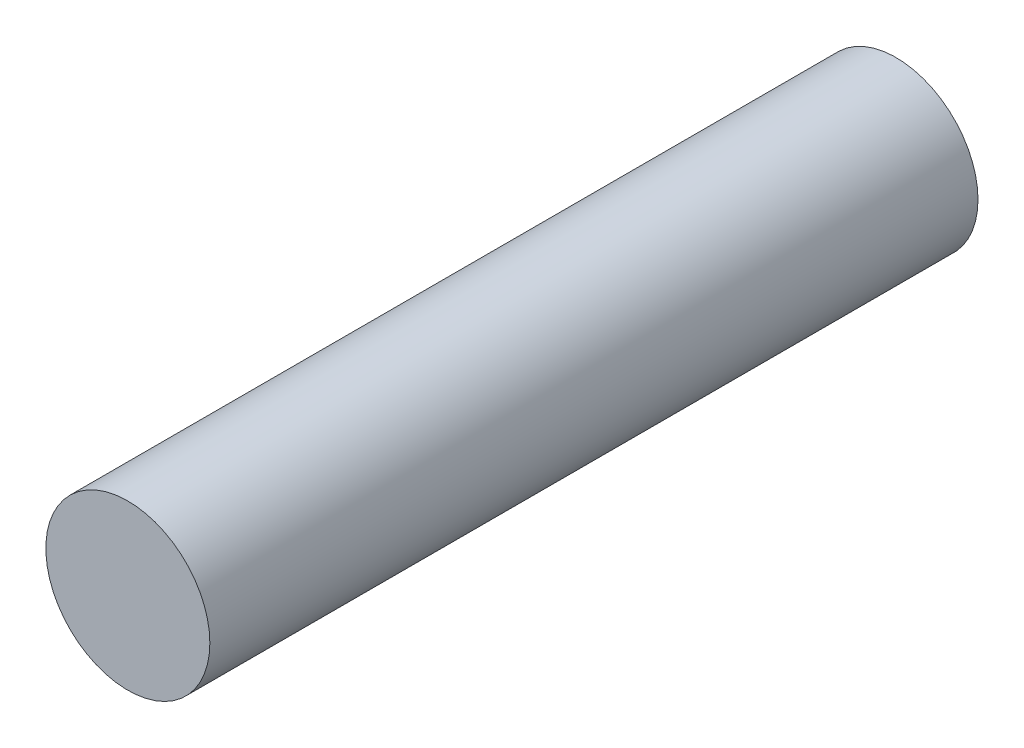
ISO-10303-21;
HEADER;
FILE_DESCRIPTION(('STEP AP214'),'2;1');
FILE_NAME('part.step','',(''),(''),'','','');
FILE_SCHEMA(('AUTOMOTIVE_DESIGN { 1 0 10303 214 1 1 1 1 }'));
ENDSEC;
DATA;
#1=APPLICATION_CONTEXT('core data for automotive mechanical design processes');
#2=APPLICATION_PROTOCOL_DEFINITION('international standard','automotive_design',2000,#1);
#3=PRODUCT_CONTEXT('',#1,'mechanical');
#4=PRODUCT('Part','Part','',(#3));
#5=PRODUCT_RELATED_PRODUCT_CATEGORY('part','',(#4));
#6=PRODUCT_DEFINITION_FORMATION('','',#4);
#7=PRODUCT_DEFINITION_CONTEXT('part definition',#1,'design');
#8=PRODUCT_DEFINITION('design','',#6,#7);
#9=PRODUCT_DEFINITION_SHAPE('','',#8);
#10=(LENGTH_UNIT() NAMED_UNIT(*) SI_UNIT(.MILLI.,.METRE.));
#11=(NAMED_UNIT(*) PLANE_ANGLE_UNIT() SI_UNIT($,.RADIAN.));
#12=(NAMED_UNIT(*) SI_UNIT($,.STERADIAN.) SOLID_ANGLE_UNIT());
#13=UNCERTAINTY_MEASURE_WITH_UNIT(LENGTH_MEASURE(1.E-05),#10,'distance_accuracy_value','');
#14=(GEOMETRIC_REPRESENTATION_CONTEXT(3) GLOBAL_UNCERTAINTY_ASSIGNED_CONTEXT((#13)) GLOBAL_UNIT_ASSIGNED_CONTEXT((#10,
#11,#12)) REPRESENTATION_CONTEXT('',''));
#15=CARTESIAN_POINT('',(0.,0.,0.));
#16=DIRECTION('',(0.,0.,1.));
#17=DIRECTION('',(1.,0.,0.));
#18=AXIS2_PLACEMENT_3D('',#15,#16,#17);
#19=CARTESIAN_POINT('',(0.,0.,14.05));
#20=DIRECTION('',(0.,0.,-1.));
#21=DIRECTION('',(-1.,0.,0.));
#22=AXIS2_PLACEMENT_3D('',#19,#20,#21);
#23=CYLINDRICAL_SURFACE('',#22,1.5);
#24=CARTESIAN_POINT('',(0.,0.,14.05));
#25=DIRECTION('',(0.,0.,1.));
#26=DIRECTION('',(1.,0.,0.));
#27=AXIS2_PLACEMENT_3D('',#24,#25,#26);
#28=CIRCLE('',#27,1.5);
#29=CARTESIAN_POINT('',(1.5,0.,14.05));
#30=VERTEX_POINT('',#29);
#31=EDGE_CURVE('E10',#30,#30,#28,.T.);
#32=ORIENTED_EDGE('',*,*,#31,.F.);
#33=EDGE_LOOP('',(#32));
#34=FACE_BOUND('',#33,.T.);
#35=CARTESIAN_POINT('',(0.,0.,0.));
#36=DIRECTION('',(0.,0.,1.));
#37=DIRECTION('',(1.,0.,0.));
#38=AXIS2_PLACEMENT_3D('',#35,#36,#37);
#39=CIRCLE('',#38,1.5);
#40=CARTESIAN_POINT('',(1.5,0.,0.));
#41=VERTEX_POINT('',#40);
#42=EDGE_CURVE('E40',#41,#41,#39,.T.);
#43=ORIENTED_EDGE('',*,*,#42,.T.);
#44=EDGE_LOOP('',(#43));
#45=FACE_BOUND('',#44,.T.);
#46=ADVANCED_FACE('F37',(#34,#45),#23,.T.);
#47=CARTESIAN_POINT('',(0.,0.,14.05));
#48=DIRECTION('',(0.,0.,1.));
#49=DIRECTION('',(1.,0.,0.));
#50=AXIS2_PLACEMENT_3D('',#47,#48,#49);
#51=PLANE('',#50);
#52=ORIENTED_EDGE('',*,*,#31,.T.);
#53=EDGE_LOOP('',(#52));
#54=FACE_BOUND('',#53,.T.);
#55=ADVANCED_FACE('F54',(#54),#51,.T.);
#56=CARTESIAN_POINT('',(0.,0.,0.));
#57=DIRECTION('',(0.,0.,1.));
#58=DIRECTION('',(1.,0.,0.));
#59=AXIS2_PLACEMENT_3D('',#56,#57,#58);
#60=PLANE('',#59);
#61=ORIENTED_EDGE('',*,*,#42,.F.);
#62=EDGE_LOOP('',(#61));
#63=FACE_BOUND('',#62,.T.);
#64=ADVANCED_FACE('F52',(#63),#60,.F.);
#65=CLOSED_SHELL('',(#46,#55,#64));
#66=MANIFOLD_SOLID_BREP('B2',#65);
#67=ADVANCED_BREP_SHAPE_REPRESENTATION('',(#18,#66),#14);
#68=SHAPE_DEFINITION_REPRESENTATION(#9,#67);
ENDSEC;
END-ISO-10303-21;
